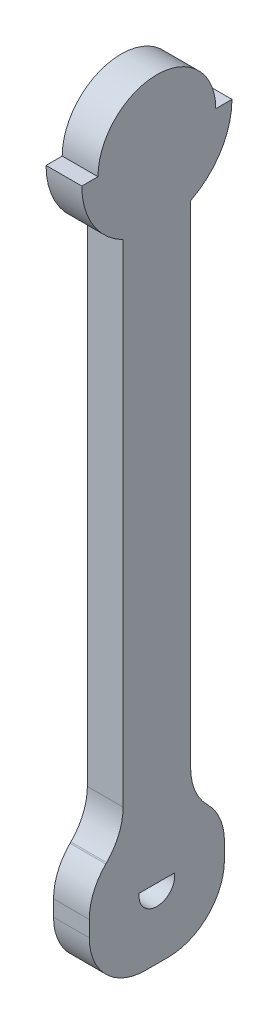
ISO-10303-21;
HEADER;
FILE_DESCRIPTION(('STEP AP214'),'2;1');
FILE_NAME('part.step','',(''),(''),'','','');
FILE_SCHEMA(('AUTOMOTIVE_DESIGN { 1 0 10303 214 1 1 1 1 }'));
ENDSEC;
DATA;
#1=APPLICATION_CONTEXT('core data for automotive mechanical design processes');
#2=APPLICATION_PROTOCOL_DEFINITION('international standard','automotive_design',2000,#1);
#3=PRODUCT_CONTEXT('',#1,'mechanical');
#4=PRODUCT('Part','Part','',(#3));
#5=PRODUCT_RELATED_PRODUCT_CATEGORY('part','',(#4));
#6=PRODUCT_DEFINITION_FORMATION('','',#4);
#7=PRODUCT_DEFINITION_CONTEXT('part definition',#1,'design');
#8=PRODUCT_DEFINITION('design','',#6,#7);
#9=PRODUCT_DEFINITION_SHAPE('','',#8);
#10=(LENGTH_UNIT() NAMED_UNIT(*) SI_UNIT(.MILLI.,.METRE.));
#11=(NAMED_UNIT(*) PLANE_ANGLE_UNIT() SI_UNIT($,.RADIAN.));
#12=(NAMED_UNIT(*) SI_UNIT($,.STERADIAN.) SOLID_ANGLE_UNIT());
#13=UNCERTAINTY_MEASURE_WITH_UNIT(LENGTH_MEASURE(1.E-05),#10,'distance_accuracy_value','');
#14=(GEOMETRIC_REPRESENTATION_CONTEXT(3) GLOBAL_UNCERTAINTY_ASSIGNED_CONTEXT((#13)) GLOBAL_UNIT_ASSIGNED_CONTEXT((#10,
#11,#12)) REPRESENTATION_CONTEXT('',''));
#15=CARTESIAN_POINT('',(0.,0.,0.));
#16=DIRECTION('',(0.,0.,1.));
#17=DIRECTION('',(1.,0.,0.));
#18=AXIS2_PLACEMENT_3D('',#15,#16,#17);
#19=CARTESIAN_POINT('',(6.35,6.00000000000001,0.));
#20=DIRECTION('',(-1.,0.,0.));
#21=DIRECTION('',(0.,0.,1.));
#22=AXIS2_PLACEMENT_3D('',#19,#20,#21);
#23=CYLINDRICAL_SURFACE('',#22,3.175);
#24=CARTESIAN_POINT('',(0.,6.00000000000001,0.));
#25=DIRECTION('',(1.,0.,0.));
#26=DIRECTION('',(0.,0.,-1.));
#27=AXIS2_PLACEMENT_3D('',#24,#25,#26);
#28=CIRCLE('',#27,3.175);
#29=CARTESIAN_POINT('',(0.,6.42500000000001,3.14642654451045));
#30=VERTEX_POINT('',#29);
#31=CARTESIAN_POINT('',(0.,6.42500000000001,-3.14642654451045));
#32=VERTEX_POINT('',#31);
#33=EDGE_CURVE('E204',#30,#32,#28,.T.);
#34=ORIENTED_EDGE('',*,*,#33,.F.);
#35=DIRECTION('',(-1.,0.,0.));
#36=VECTOR('',#35,1.);
#37=CARTESIAN_POINT('',(6.35,6.42500000000001,3.14642654451045));
#38=LINE('',#37,#36);
#39=CARTESIAN_POINT('',(6.35,6.42500000000001,3.14642654451045));
#40=VERTEX_POINT('',#39);
#41=EDGE_CURVE('E266',#40,#30,#38,.T.);
#42=ORIENTED_EDGE('',*,*,#41,.F.);
#43=CARTESIAN_POINT('',(6.35,6.00000000000001,0.));
#44=DIRECTION('',(1.,0.,0.));
#45=DIRECTION('',(0.,0.,-1.));
#46=AXIS2_PLACEMENT_3D('',#43,#44,#45);
#47=CIRCLE('',#46,3.175);
#48=CARTESIAN_POINT('',(6.35,6.42500000000001,-3.14642654451045));
#49=VERTEX_POINT('',#48);
#50=EDGE_CURVE('E228',#40,#49,#47,.T.);
#51=ORIENTED_EDGE('',*,*,#50,.T.);
#52=DIRECTION('',(-1.,0.,0.));
#53=VECTOR('',#52,1.);
#54=CARTESIAN_POINT('',(6.35,6.42500000000001,-3.14642654451045));
#55=LINE('',#54,#53);
#56=EDGE_CURVE('E185',#49,#32,#55,.T.);
#57=ORIENTED_EDGE('',*,*,#56,.T.);
#58=EDGE_LOOP('',(#34,#42,#51,#57));
#59=FACE_BOUND('',#58,.T.);
#60=ADVANCED_FACE('F35',(#59),#23,.F.);
#61=CARTESIAN_POINT('',(6.35,0.,-6.00000000000001));
#62=DIRECTION('',(0.,0.,-1.));
#63=DIRECTION('',(0.,1.,0.));
#64=AXIS2_PLACEMENT_3D('',#61,#62,#63);
#65=PLANE('',#64);
#66=DIRECTION('',(0.,-1.,0.));
#67=VECTOR('',#66,1.);
#68=CARTESIAN_POINT('',(6.35,0.,-6.00000000000001));
#69=LINE('',#68,#67);
#70=CARTESIAN_POINT('',(6.35,108.391086321582,-5.99999999999995));
#71=VERTEX_POINT('',#70);
#72=CARTESIAN_POINT('',(6.35,21.1126983722081,-6.));
#73=VERTEX_POINT('',#72);
#74=EDGE_CURVE('E178',#71,#73,#69,.T.);
#75=ORIENTED_EDGE('',*,*,#74,.T.);
#76=DIRECTION('',(-1.,0.,0.));
#77=VECTOR('',#76,1.);
#78=CARTESIAN_POINT('',(6.35,21.1126983722081,-6.));
#79=LINE('',#78,#77);
#80=CARTESIAN_POINT('',(0.,21.1126983722081,-6.));
#81=VERTEX_POINT('',#80);
#82=EDGE_CURVE('E268',#73,#81,#79,.T.);
#83=ORIENTED_EDGE('',*,*,#82,.T.);
#84=DIRECTION('',(0.,-1.,0.));
#85=VECTOR('',#84,1.);
#86=CARTESIAN_POINT('',(0.,0.,-6.00000000000001));
#87=LINE('',#86,#85);
#88=CARTESIAN_POINT('',(0.,108.391086321582,-5.99999999999995));
#89=VERTEX_POINT('',#88);
#90=EDGE_CURVE('E181',#89,#81,#87,.T.);
#91=ORIENTED_EDGE('',*,*,#90,.F.);
#92=DIRECTION('',(-1.,0.,0.));
#93=VECTOR('',#92,1.);
#94=CARTESIAN_POINT('',(6.35,108.391086321582,-5.99999999999995));
#95=LINE('',#94,#93);
#96=EDGE_CURVE('E173',#71,#89,#95,.T.);
#97=ORIENTED_EDGE('',*,*,#96,.F.);
#98=EDGE_LOOP('',(#75,#83,#91,#97));
#99=FACE_BOUND('',#98,.T.);
#100=ADVANCED_FACE('F175',(#99),#65,.T.);
#101=CARTESIAN_POINT('',(6.35,120.3,0.));
#102=DIRECTION('',(-1.,0.,0.));
#103=DIRECTION('',(0.,0.,1.));
#104=AXIS2_PLACEMENT_3D('',#101,#102,#103);
#105=CYLINDRICAL_SURFACE('',#104,13.335);
#106=CARTESIAN_POINT('',(0.,120.3,0.));
#107=DIRECTION('',(1.,0.,0.));
#108=DIRECTION('',(0.,0.,-1.));
#109=AXIS2_PLACEMENT_3D('',#106,#107,#108);
#110=CIRCLE('',#109,13.335);
#111=CARTESIAN_POINT('',(0.,120.3,-13.335));
#112=VERTEX_POINT('',#111);
#113=EDGE_CURVE('E235',#89,#112,#110,.T.);
#114=ORIENTED_EDGE('',*,*,#113,.T.);
#115=DIRECTION('',(-1.,0.,0.));
#116=VECTOR('',#115,1.);
#117=CARTESIAN_POINT('',(6.35,120.3,-13.335));
#118=LINE('',#117,#116);
#119=CARTESIAN_POINT('',(6.35,120.3,-13.335));
#120=VERTEX_POINT('',#119);
#121=EDGE_CURVE('E186',#120,#112,#118,.T.);
#122=ORIENTED_EDGE('',*,*,#121,.F.);
#123=CARTESIAN_POINT('',(6.35,120.3,0.));
#124=DIRECTION('',(1.,0.,0.));
#125=DIRECTION('',(0.,0.,-1.));
#126=AXIS2_PLACEMENT_3D('',#123,#124,#125);
#127=CIRCLE('',#126,13.335);
#128=EDGE_CURVE('E189',#71,#120,#127,.T.);
#129=ORIENTED_EDGE('',*,*,#128,.F.);
#130=ORIENTED_EDGE('',*,*,#96,.T.);
#131=EDGE_LOOP('',(#114,#122,#129,#130));
#132=FACE_BOUND('',#131,.T.);
#133=ADVANCED_FACE('F190',(#132),#105,.T.);
#134=CARTESIAN_POINT('',(6.35,120.3,0.));
#135=DIRECTION('',(0.,1.,0.));
#136=DIRECTION('',(0.,0.,1.));
#137=AXIS2_PLACEMENT_3D('',#134,#135,#136);
#138=PLANE('',#137);
#139=DIRECTION('',(0.,0.,-1.));
#140=VECTOR('',#139,1.);
#141=CARTESIAN_POINT('',(0.,120.3,0.));
#142=LINE('',#141,#140);
#143=CARTESIAN_POINT('',(0.,120.3,-10.4648));
#144=VERTEX_POINT('',#143);
#145=EDGE_CURVE('E237',#144,#112,#142,.T.);
#146=ORIENTED_EDGE('',*,*,#145,.F.);
#147=DIRECTION('',(-1.,0.,0.));
#148=VECTOR('',#147,1.);
#149=CARTESIAN_POINT('',(6.35,120.3,-10.4648));
#150=LINE('',#149,#148);
#151=CARTESIAN_POINT('',(6.35,120.3,-10.4648));
#152=VERTEX_POINT('',#151);
#153=EDGE_CURVE('E277',#152,#144,#150,.T.);
#154=ORIENTED_EDGE('',*,*,#153,.F.);
#155=DIRECTION('',(0.,0.,-1.));
#156=VECTOR('',#155,1.);
#157=CARTESIAN_POINT('',(6.35,120.3,0.));
#158=LINE('',#157,#156);
#159=EDGE_CURVE('E193',#152,#120,#158,.T.);
#160=ORIENTED_EDGE('',*,*,#159,.T.);
#161=ORIENTED_EDGE('',*,*,#121,.T.);
#162=EDGE_LOOP('',(#146,#154,#160,#161));
#163=FACE_BOUND('',#162,.T.);
#164=ADVANCED_FACE('F418',(#163),#138,.T.);
#165=CARTESIAN_POINT('',(6.35,120.3,0.));
#166=DIRECTION('',(-1.,0.,0.));
#167=DIRECTION('',(0.,0.,1.));
#168=AXIS2_PLACEMENT_3D('',#165,#166,#167);
#169=CYLINDRICAL_SURFACE('',#168,10.4648);
#170=CARTESIAN_POINT('',(0.,120.3,0.));
#171=DIRECTION('',(1.,0.,0.));
#172=DIRECTION('',(0.,0.,-1.));
#173=AXIS2_PLACEMENT_3D('',#170,#171,#172);
#174=CIRCLE('',#173,10.4648);
#175=CARTESIAN_POINT('',(0.,120.3,10.4648));
#176=VERTEX_POINT('',#175);
#177=EDGE_CURVE('E240',#144,#176,#174,.T.);
#178=ORIENTED_EDGE('',*,*,#177,.T.);
#179=DIRECTION('',(-1.,0.,0.));
#180=VECTOR('',#179,1.);
#181=CARTESIAN_POINT('',(6.35,120.3,10.4648));
#182=LINE('',#181,#180);
#183=CARTESIAN_POINT('',(6.35,120.3,10.4648));
#184=VERTEX_POINT('',#183);
#185=EDGE_CURVE('E274',#184,#176,#182,.T.);
#186=ORIENTED_EDGE('',*,*,#185,.F.);
#187=CARTESIAN_POINT('',(6.35,120.3,0.));
#188=DIRECTION('',(1.,0.,0.));
#189=DIRECTION('',(0.,0.,-1.));
#190=AXIS2_PLACEMENT_3D('',#187,#188,#189);
#191=CIRCLE('',#190,10.4648);
#192=EDGE_CURVE('E208',#152,#184,#191,.T.);
#193=ORIENTED_EDGE('',*,*,#192,.F.);
#194=ORIENTED_EDGE('',*,*,#153,.T.);
#195=EDGE_LOOP('',(#178,#186,#193,#194));
#196=FACE_BOUND('',#195,.T.);
#197=ADVANCED_FACE('F414',(#196),#169,.T.);
#198=CARTESIAN_POINT('',(6.35,120.3,0.));
#199=DIRECTION('',(0.,-1.,0.));
#200=DIRECTION('',(0.,0.,-1.));
#201=AXIS2_PLACEMENT_3D('',#198,#199,#200);
#202=PLANE('',#201);
#203=DIRECTION('',(0.,0.,1.));
#204=VECTOR('',#203,1.);
#205=CARTESIAN_POINT('',(0.,120.3,0.));
#206=LINE('',#205,#204);
#207=CARTESIAN_POINT('',(0.,120.3,13.335));
#208=VERTEX_POINT('',#207);
#209=EDGE_CURVE('E242',#176,#208,#206,.T.);
#210=ORIENTED_EDGE('',*,*,#209,.T.);
#211=DIRECTION('',(-1.,0.,0.));
#212=VECTOR('',#211,1.);
#213=CARTESIAN_POINT('',(6.35,120.3,13.335));
#214=LINE('',#213,#212);
#215=CARTESIAN_POINT('',(6.35,120.3,13.335));
#216=VERTEX_POINT('',#215);
#217=EDGE_CURVE('E271',#216,#208,#214,.T.);
#218=ORIENTED_EDGE('',*,*,#217,.F.);
#219=DIRECTION('',(0.,0.,1.));
#220=VECTOR('',#219,1.);
#221=CARTESIAN_POINT('',(6.35,120.3,0.));
#222=LINE('',#221,#220);
#223=EDGE_CURVE('E210',#184,#216,#222,.T.);
#224=ORIENTED_EDGE('',*,*,#223,.F.);
#225=ORIENTED_EDGE('',*,*,#185,.T.);
#226=EDGE_LOOP('',(#210,#218,#224,#225));
#227=FACE_BOUND('',#226,.T.);
#228=ADVANCED_FACE('F410',(#227),#202,.F.);
#229=CARTESIAN_POINT('',(6.35,120.3,0.));
#230=DIRECTION('',(-1.,0.,0.));
#231=DIRECTION('',(0.,0.,1.));
#232=AXIS2_PLACEMENT_3D('',#229,#230,#231);
#233=CYLINDRICAL_SURFACE('',#232,13.335);
#234=CARTESIAN_POINT('',(0.,120.3,0.));
#235=DIRECTION('',(1.,0.,0.));
#236=DIRECTION('',(0.,0.,-1.));
#237=AXIS2_PLACEMENT_3D('',#234,#235,#236);
#238=CIRCLE('',#237,13.335);
#239=CARTESIAN_POINT('',(0.,108.391086321583,6.00000000000005));
#240=VERTEX_POINT('',#239);
#241=EDGE_CURVE('E244',#208,#240,#238,.T.);
#242=ORIENTED_EDGE('',*,*,#241,.T.);
#243=DIRECTION('',(-1.,0.,0.));
#244=VECTOR('',#243,1.);
#245=CARTESIAN_POINT('',(6.35,108.391086321583,6.00000000000005));
#246=LINE('',#245,#244);
#247=CARTESIAN_POINT('',(6.35,108.391086321583,6.00000000000005));
#248=VERTEX_POINT('',#247);
#249=EDGE_CURVE('E233',#248,#240,#246,.T.);
#250=ORIENTED_EDGE('',*,*,#249,.F.);
#251=CARTESIAN_POINT('',(6.35,120.3,0.));
#252=DIRECTION('',(1.,0.,0.));
#253=DIRECTION('',(0.,0.,-1.));
#254=AXIS2_PLACEMENT_3D('',#251,#252,#253);
#255=CIRCLE('',#254,13.335);
#256=EDGE_CURVE('E212',#216,#248,#255,.T.);
#257=ORIENTED_EDGE('',*,*,#256,.F.);
#258=ORIENTED_EDGE('',*,*,#217,.T.);
#259=EDGE_LOOP('',(#242,#250,#257,#258));
#260=FACE_BOUND('',#259,.T.);
#261=ADVANCED_FACE('F407',(#260),#233,.T.);
#262=CARTESIAN_POINT('',(6.35,0.,5.99999999999999));
#263=DIRECTION('',(0.,0.,-1.));
#264=DIRECTION('',(0.,1.,0.));
#265=AXIS2_PLACEMENT_3D('',#262,#263,#264);
#266=PLANE('',#265);
#267=DIRECTION('',(0.,-1.,0.));
#268=VECTOR('',#267,1.);
#269=CARTESIAN_POINT('',(0.,0.,5.99999999999999));
#270=LINE('',#269,#268);
#271=CARTESIAN_POINT('',(0.,21.1126983722081,6.));
#272=VERTEX_POINT('',#271);
#273=EDGE_CURVE('E246',#240,#272,#270,.T.);
#274=ORIENTED_EDGE('',*,*,#273,.T.);
#275=DIRECTION('',(-1.,0.,0.));
#276=VECTOR('',#275,1.);
#277=CARTESIAN_POINT('',(6.35,21.1126983722081,6.));
#278=LINE('',#277,#276);
#279=CARTESIAN_POINT('',(6.35,21.1126983722081,6.));
#280=VERTEX_POINT('',#279);
#281=EDGE_CURVE('E320',#272,#280,#278,.F.);
#282=ORIENTED_EDGE('',*,*,#281,.T.);
#283=DIRECTION('',(0.,-1.,0.));
#284=VECTOR('',#283,1.);
#285=CARTESIAN_POINT('',(6.35,0.,5.99999999999999));
#286=LINE('',#285,#284);
#287=EDGE_CURVE('E214',#248,#280,#286,.T.);
#288=ORIENTED_EDGE('',*,*,#287,.F.);
#289=ORIENTED_EDGE('',*,*,#249,.T.);
#290=EDGE_LOOP('',(#274,#282,#288,#289));
#291=FACE_BOUND('',#290,.T.);
#292=ADVANCED_FACE('F335',(#291),#266,.F.);
#293=CARTESIAN_POINT('',(6.35,11.4852813742386,11.4852813742386));
#294=DIRECTION('',(0.,-0.707106781186548,-0.707106781186547));
#295=DIRECTION('',(0.,0.707106781186547,-0.707106781186548));
#296=AXIS2_PLACEMENT_3D('',#293,#294,#295);
#297=PLANE('',#296);
#298=DIRECTION('',(0.,-0.707106781186547,0.707106781186548));
#299=VECTOR('',#298,1.);
#300=CARTESIAN_POINT('',(0.,11.4852813742386,11.4852813742386));
#301=LINE('',#300,#299);
#302=CARTESIAN_POINT('',(0.,14.0416305603426,8.92893218813453));
#303=VERTEX_POINT('',#302);
#304=CARTESIAN_POINT('',(0.,13.8994949366117,9.07106781186547));
#305=VERTEX_POINT('',#304);
#306=EDGE_CURVE('E249',#303,#305,#301,.T.);
#307=ORIENTED_EDGE('',*,*,#306,.T.);
#308=DIRECTION('',(-1.,0.,0.));
#309=VECTOR('',#308,1.);
#310=CARTESIAN_POINT('',(6.35,13.8994949366117,9.07106781186547));
#311=LINE('',#310,#309);
#312=CARTESIAN_POINT('',(6.35,13.8994949366117,9.07106781186547));
#313=VERTEX_POINT('',#312);
#314=EDGE_CURVE('E318',#305,#313,#311,.F.);
#315=ORIENTED_EDGE('',*,*,#314,.T.);
#316=DIRECTION('',(0.,-0.707106781186547,0.707106781186548));
#317=VECTOR('',#316,1.);
#318=CARTESIAN_POINT('',(6.35,11.4852813742386,11.4852813742386));
#319=LINE('',#318,#317);
#320=CARTESIAN_POINT('',(6.35,14.0416305603426,8.92893218813453));
#321=VERTEX_POINT('',#320);
#322=EDGE_CURVE('E217',#321,#313,#319,.T.);
#323=ORIENTED_EDGE('',*,*,#322,.F.);
#324=DIRECTION('',(-1.,0.,0.));
#325=VECTOR('',#324,1.);
#326=CARTESIAN_POINT('',(0.,14.0416305603426,8.92893218813453));
#327=LINE('',#326,#325);
#328=EDGE_CURVE('E315',#321,#303,#327,.T.);
#329=ORIENTED_EDGE('',*,*,#328,.T.);
#330=EDGE_LOOP('',(#307,#315,#323,#329));
#331=FACE_BOUND('',#330,.T.);
#332=ADVANCED_FACE('F342',(#331),#297,.F.);
#333=CARTESIAN_POINT('',(6.35,0.,12.));
#334=DIRECTION('',(0.,0.,-1.));
#335=DIRECTION('',(0.,1.,0.));
#336=AXIS2_PLACEMENT_3D('',#333,#334,#335);
#337=PLANE('',#336);
#338=DIRECTION('',(0.,-1.,0.));
#339=VECTOR('',#338,1.);
#340=CARTESIAN_POINT('',(0.,0.,12.));
#341=LINE('',#340,#339);
#342=CARTESIAN_POINT('',(0.,6.82842712474619,12.));
#343=VERTEX_POINT('',#342);
#344=CARTESIAN_POINT('',(0.,4.00000000000001,12.));
#345=VERTEX_POINT('',#344);
#346=EDGE_CURVE('E252',#343,#345,#341,.T.);
#347=ORIENTED_EDGE('',*,*,#346,.T.);
#348=DIRECTION('',(-1.,0.,0.));
#349=VECTOR('',#348,1.);
#350=CARTESIAN_POINT('',(6.35,4.00000000000001,12.));
#351=LINE('',#350,#349);
#352=CARTESIAN_POINT('',(6.35,4.00000000000001,12.));
#353=VERTEX_POINT('',#352);
#354=EDGE_CURVE('E313',#345,#353,#351,.F.);
#355=ORIENTED_EDGE('',*,*,#354,.T.);
#356=DIRECTION('',(0.,-1.,0.));
#357=VECTOR('',#356,1.);
#358=CARTESIAN_POINT('',(6.35,0.,12.));
#359=LINE('',#358,#357);
#360=CARTESIAN_POINT('',(6.35,6.82842712474619,12.));
#361=VERTEX_POINT('',#360);
#362=EDGE_CURVE('E220',#361,#353,#359,.T.);
#363=ORIENTED_EDGE('',*,*,#362,.F.);
#364=DIRECTION('',(-1.,0.,0.));
#365=VECTOR('',#364,1.);
#366=CARTESIAN_POINT('',(6.35,6.82842712474619,12.));
#367=LINE('',#366,#365);
#368=EDGE_CURVE('E310',#361,#343,#367,.T.);
#369=ORIENTED_EDGE('',*,*,#368,.T.);
#370=EDGE_LOOP('',(#347,#355,#363,#369));
#371=FACE_BOUND('',#370,.T.);
#372=ADVANCED_FACE('F349',(#371),#337,.F.);
#373=CARTESIAN_POINT('',(6.35,-5.99999999999999,0.));
#374=DIRECTION('',(0.,1.,0.));
#375=DIRECTION('',(0.,0.,1.));
#376=AXIS2_PLACEMENT_3D('',#373,#374,#375);
#377=PLANE('',#376);
#378=DIRECTION('',(0.,0.,-1.));
#379=VECTOR('',#378,1.);
#380=CARTESIAN_POINT('',(0.,-5.99999999999999,0.));
#381=LINE('',#380,#379);
#382=CARTESIAN_POINT('',(0.,-5.99999999999999,2.));
#383=VERTEX_POINT('',#382);
#384=CARTESIAN_POINT('',(0.,-5.99999999999999,-2.));
#385=VERTEX_POINT('',#384);
#386=EDGE_CURVE('E255',#383,#385,#381,.T.);
#387=ORIENTED_EDGE('',*,*,#386,.T.);
#388=DIRECTION('',(-1.,0.,0.));
#389=VECTOR('',#388,1.);
#390=CARTESIAN_POINT('',(6.35,-5.99999999999999,-2.));
#391=LINE('',#390,#389);
#392=CARTESIAN_POINT('',(6.35,-5.99999999999999,-2.));
#393=VERTEX_POINT('',#392);
#394=EDGE_CURVE('E50',#385,#393,#391,.F.);
#395=ORIENTED_EDGE('',*,*,#394,.T.);
#396=DIRECTION('',(0.,0.,-1.));
#397=VECTOR('',#396,1.);
#398=CARTESIAN_POINT('',(6.35,-5.99999999999999,0.));
#399=LINE('',#398,#397);
#400=CARTESIAN_POINT('',(6.35,-5.99999999999999,2.));
#401=VERTEX_POINT('',#400);
#402=EDGE_CURVE('E222',#401,#393,#399,.T.);
#403=ORIENTED_EDGE('',*,*,#402,.F.);
#404=DIRECTION('',(-1.,0.,0.));
#405=VECTOR('',#404,1.);
#406=CARTESIAN_POINT('',(6.35,-5.99999999999999,2.));
#407=LINE('',#406,#405);
#408=EDGE_CURVE('E306',#401,#383,#407,.T.);
#409=ORIENTED_EDGE('',*,*,#408,.T.);
#410=EDGE_LOOP('',(#387,#395,#403,#409));
#411=FACE_BOUND('',#410,.T.);
#412=ADVANCED_FACE('F356',(#411),#377,.F.);
#413=CARTESIAN_POINT('',(6.35,0.,-12.));
#414=DIRECTION('',(0.,0.,1.));
#415=DIRECTION('',(1.,0.,0.));
#416=AXIS2_PLACEMENT_3D('',#413,#414,#415);
#417=PLANE('',#416);
#418=DIRECTION('',(0.,1.,0.));
#419=VECTOR('',#418,1.);
#420=CARTESIAN_POINT('',(0.,0.,-12.));
#421=LINE('',#420,#419);
#422=CARTESIAN_POINT('',(0.,4.00000000000001,-12.));
#423=VERTEX_POINT('',#422);
#424=CARTESIAN_POINT('',(0.,6.82842712474619,-12.));
#425=VERTEX_POINT('',#424);
#426=EDGE_CURVE('E257',#423,#425,#421,.T.);
#427=ORIENTED_EDGE('',*,*,#426,.T.);
#428=DIRECTION('',(-1.,0.,0.));
#429=VECTOR('',#428,1.);
#430=CARTESIAN_POINT('',(6.35,6.82842712474619,-12.));
#431=LINE('',#430,#429);
#432=CARTESIAN_POINT('',(6.35,6.82842712474619,-12.));
#433=VERTEX_POINT('',#432);
#434=EDGE_CURVE('E297',#425,#433,#431,.F.);
#435=ORIENTED_EDGE('',*,*,#434,.T.);
#436=DIRECTION('',(0.,1.,0.));
#437=VECTOR('',#436,1.);
#438=CARTESIAN_POINT('',(6.35,0.,-12.));
#439=LINE('',#438,#437);
#440=CARTESIAN_POINT('',(6.35,4.00000000000001,-12.));
#441=VERTEX_POINT('',#440);
#442=EDGE_CURVE('E224',#441,#433,#439,.T.);
#443=ORIENTED_EDGE('',*,*,#442,.F.);
#444=DIRECTION('',(-1.,0.,0.));
#445=VECTOR('',#444,1.);
#446=CARTESIAN_POINT('',(6.35,4.00000000000001,-12.));
#447=LINE('',#446,#445);
#448=EDGE_CURVE('E294',#441,#423,#447,.T.);
#449=ORIENTED_EDGE('',*,*,#448,.T.);
#450=EDGE_LOOP('',(#427,#435,#443,#449));
#451=FACE_BOUND('',#450,.T.);
#452=ADVANCED_FACE('F364',(#451),#417,.F.);
#453=CARTESIAN_POINT('',(6.35,11.4852813742385,-11.4852813742386));
#454=DIRECTION('',(0.,-0.707106781186544,0.70710678118655));
#455=DIRECTION('',(0.,-0.707106781186551,-0.707106781186545));
#456=AXIS2_PLACEMENT_3D('',#453,#454,#455);
#457=PLANE('',#456);
#458=DIRECTION('',(0.,0.707106781186551,0.707106781186545));
#459=VECTOR('',#458,1.);
#460=CARTESIAN_POINT('',(0.,11.4852813742385,-11.4852813742386));
#461=LINE('',#460,#459);
#462=CARTESIAN_POINT('',(0.,13.8994949366116,-9.07106781186551));
#463=VERTEX_POINT('',#462);
#464=CARTESIAN_POINT('',(0.,14.0416305603426,-8.9289321881345));
#465=VERTEX_POINT('',#464);
#466=EDGE_CURVE('E260',#463,#465,#461,.T.);
#467=ORIENTED_EDGE('',*,*,#466,.T.);
#468=DIRECTION('',(-1.,0.,0.));
#469=VECTOR('',#468,1.);
#470=CARTESIAN_POINT('',(6.35,14.0416305603426,-8.9289321881345));
#471=LINE('',#470,#469);
#472=CARTESIAN_POINT('',(6.35,14.0416305603426,-8.9289321881345));
#473=VERTEX_POINT('',#472);
#474=EDGE_CURVE('E284',#465,#473,#471,.F.);
#475=ORIENTED_EDGE('',*,*,#474,.T.);
#476=DIRECTION('',(0.,0.707106781186551,0.707106781186545));
#477=VECTOR('',#476,1.);
#478=CARTESIAN_POINT('',(6.35,11.4852813742385,-11.4852813742386));
#479=LINE('',#478,#477);
#480=CARTESIAN_POINT('',(6.35,13.8994949366116,-9.07106781186551));
#481=VERTEX_POINT('',#480);
#482=EDGE_CURVE('E226',#481,#473,#479,.T.);
#483=ORIENTED_EDGE('',*,*,#482,.F.);
#484=DIRECTION('',(-1.,0.,0.));
#485=VECTOR('',#484,1.);
#486=CARTESIAN_POINT('',(6.35,13.8994949366116,-9.07106781186551));
#487=LINE('',#486,#485);
#488=EDGE_CURVE('E281',#481,#463,#487,.T.);
#489=ORIENTED_EDGE('',*,*,#488,.T.);
#490=EDGE_LOOP('',(#467,#475,#483,#489));
#491=FACE_BOUND('',#490,.T.);
#492=ADVANCED_FACE('F372',(#491),#457,.F.);
#493=CARTESIAN_POINT('',(6.35,6.42500000000001,0.));
#494=DIRECTION('',(0.,1.,0.));
#495=DIRECTION('',(0.,0.,1.));
#496=AXIS2_PLACEMENT_3D('',#493,#494,#495);
#497=PLANE('',#496);
#498=DIRECTION('',(0.,0.,-1.));
#499=VECTOR('',#498,1.);
#500=CARTESIAN_POINT('',(0.,6.42500000000001,0.));
#501=LINE('',#500,#499);
#502=EDGE_CURVE('E201',#30,#32,#501,.T.);
#503=ORIENTED_EDGE('',*,*,#502,.T.);
#504=ORIENTED_EDGE('',*,*,#56,.F.);
#505=DIRECTION('',(0.,0.,-1.));
#506=VECTOR('',#505,1.);
#507=CARTESIAN_POINT('',(6.35,6.42500000000001,0.));
#508=LINE('',#507,#506);
#509=EDGE_CURVE('E231',#40,#49,#508,.T.);
#510=ORIENTED_EDGE('',*,*,#509,.F.);
#511=ORIENTED_EDGE('',*,*,#41,.T.);
#512=EDGE_LOOP('',(#503,#504,#510,#511));
#513=FACE_BOUND('',#512,.T.);
#514=ADVANCED_FACE('F394',(#513),#497,.F.);
#515=CARTESIAN_POINT('',(6.35,0.,0.));
#516=DIRECTION('',(1.,0.,0.));
#517=DIRECTION('',(0.,0.,-1.));
#518=AXIS2_PLACEMENT_3D('',#515,#516,#517);
#519=PLANE('',#518);
#520=ORIENTED_EDGE('',*,*,#442,.T.);
#521=CARTESIAN_POINT('',(6.35,6.82842712474619,-2.));
#522=DIRECTION('',(1.,0.,0.));
#523=DIRECTION('',(0.,0.,-1.));
#524=AXIS2_PLACEMENT_3D('',#521,#522,#523);
#525=CIRCLE('',#524,10.);
#526=EDGE_CURVE('E304',#433,#481,#525,.T.);
#527=ORIENTED_EDGE('',*,*,#526,.T.);
#528=ORIENTED_EDGE('',*,*,#482,.T.);
#529=CARTESIAN_POINT('',(6.35,21.1126983722081,-16.));
#530=DIRECTION('',(1.,0.,0.));
#531=DIRECTION('',(0.,0.,-1.));
#532=AXIS2_PLACEMENT_3D('',#529,#530,#531);
#533=CIRCLE('',#532,10.);
#534=EDGE_CURVE('E200',#473,#73,#533,.F.);
#535=ORIENTED_EDGE('',*,*,#534,.T.);
#536=ORIENTED_EDGE('',*,*,#74,.F.);
#537=ORIENTED_EDGE('',*,*,#128,.T.);
#538=ORIENTED_EDGE('',*,*,#159,.F.);
#539=ORIENTED_EDGE('',*,*,#192,.T.);
#540=ORIENTED_EDGE('',*,*,#223,.T.);
#541=ORIENTED_EDGE('',*,*,#256,.T.);
#542=ORIENTED_EDGE('',*,*,#287,.T.);
#543=CARTESIAN_POINT('',(6.35,21.1126983722081,16.));
#544=DIRECTION('',(1.,0.,0.));
#545=DIRECTION('',(0.,0.,-1.));
#546=AXIS2_PLACEMENT_3D('',#543,#544,#545);
#547=CIRCLE('',#546,10.);
#548=EDGE_CURVE('E11',#280,#321,#547,.F.);
#549=ORIENTED_EDGE('',*,*,#548,.T.);
#550=ORIENTED_EDGE('',*,*,#322,.T.);
#551=CARTESIAN_POINT('',(6.35,6.82842712474619,2.));
#552=DIRECTION('',(1.,0.,0.));
#553=DIRECTION('',(0.,0.,-1.));
#554=AXIS2_PLACEMENT_3D('',#551,#552,#553);
#555=CIRCLE('',#554,10.);
#556=EDGE_CURVE('E299',#313,#361,#555,.T.);
#557=ORIENTED_EDGE('',*,*,#556,.T.);
#558=ORIENTED_EDGE('',*,*,#362,.T.);
#559=CARTESIAN_POINT('',(6.35,4.00000000000001,2.));
#560=DIRECTION('',(1.,0.,0.));
#561=DIRECTION('',(0.,0.,-1.));
#562=AXIS2_PLACEMENT_3D('',#559,#560,#561);
#563=CIRCLE('',#562,10.);
#564=EDGE_CURVE('E57',#353,#401,#563,.T.);
#565=ORIENTED_EDGE('',*,*,#564,.T.);
#566=ORIENTED_EDGE('',*,*,#402,.T.);
#567=CARTESIAN_POINT('',(6.35,4.00000000000001,-2.));
#568=DIRECTION('',(1.,0.,0.));
#569=DIRECTION('',(0.,0.,-1.));
#570=AXIS2_PLACEMENT_3D('',#567,#568,#569);
#571=CIRCLE('',#570,10.);
#572=EDGE_CURVE('E302',#393,#441,#571,.T.);
#573=ORIENTED_EDGE('',*,*,#572,.T.);
#574=EDGE_LOOP('',(#520,#527,#528,#535,#536,#537,#538,#539,#540,#541,#542,#549,#550,#557,#558,
#565,#566,#573));
#575=FACE_BOUND('',#574,.T.);
#576=ORIENTED_EDGE('',*,*,#50,.F.);
#577=ORIENTED_EDGE('',*,*,#509,.T.);
#578=EDGE_LOOP('',(#576,#577));
#579=FACE_BOUND('',#578,.T.);
#580=ADVANCED_FACE('F196',(#575,#579),#519,.T.);
#581=CARTESIAN_POINT('',(0.,0.,0.));
#582=DIRECTION('',(1.,0.,0.));
#583=DIRECTION('',(0.,0.,-1.));
#584=AXIS2_PLACEMENT_3D('',#581,#582,#583);
#585=PLANE('',#584);
#586=ORIENTED_EDGE('',*,*,#466,.F.);
#587=CARTESIAN_POINT('',(0.,6.82842712474619,-2.));
#588=DIRECTION('',(1.,0.,0.));
#589=DIRECTION('',(0.,0.,-1.));
#590=AXIS2_PLACEMENT_3D('',#587,#588,#589);
#591=CIRCLE('',#590,10.);
#592=EDGE_CURVE('E292',#463,#425,#591,.F.);
#593=ORIENTED_EDGE('',*,*,#592,.T.);
#594=ORIENTED_EDGE('',*,*,#426,.F.);
#595=CARTESIAN_POINT('',(0.,4.00000000000001,-2.));
#596=DIRECTION('',(1.,0.,0.));
#597=DIRECTION('',(0.,0.,-1.));
#598=AXIS2_PLACEMENT_3D('',#595,#596,#597);
#599=CIRCLE('',#598,10.);
#600=EDGE_CURVE('E290',#423,#385,#599,.F.);
#601=ORIENTED_EDGE('',*,*,#600,.T.);
#602=ORIENTED_EDGE('',*,*,#386,.F.);
#603=CARTESIAN_POINT('',(0.,4.00000000000001,2.));
#604=DIRECTION('',(1.,0.,0.));
#605=DIRECTION('',(0.,0.,-1.));
#606=AXIS2_PLACEMENT_3D('',#603,#604,#605);
#607=CIRCLE('',#606,10.);
#608=EDGE_CURVE('E288',#383,#345,#607,.F.);
#609=ORIENTED_EDGE('',*,*,#608,.T.);
#610=ORIENTED_EDGE('',*,*,#346,.F.);
#611=CARTESIAN_POINT('',(0.,6.82842712474619,2.));
#612=DIRECTION('',(1.,0.,0.));
#613=DIRECTION('',(0.,0.,-1.));
#614=AXIS2_PLACEMENT_3D('',#611,#612,#613);
#615=CIRCLE('',#614,10.);
#616=EDGE_CURVE('E286',#343,#305,#615,.F.);
#617=ORIENTED_EDGE('',*,*,#616,.T.);
#618=ORIENTED_EDGE('',*,*,#306,.F.);
#619=CARTESIAN_POINT('',(0.,21.1126983722081,16.));
#620=DIRECTION('',(1.,0.,0.));
#621=DIRECTION('',(0.,0.,-1.));
#622=AXIS2_PLACEMENT_3D('',#619,#620,#621);
#623=CIRCLE('',#622,10.);
#624=EDGE_CURVE('E43',#303,#272,#623,.T.);
#625=ORIENTED_EDGE('',*,*,#624,.T.);
#626=ORIENTED_EDGE('',*,*,#273,.F.);
#627=ORIENTED_EDGE('',*,*,#241,.F.);
#628=ORIENTED_EDGE('',*,*,#209,.F.);
#629=ORIENTED_EDGE('',*,*,#177,.F.);
#630=ORIENTED_EDGE('',*,*,#145,.T.);
#631=ORIENTED_EDGE('',*,*,#113,.F.);
#632=ORIENTED_EDGE('',*,*,#90,.T.);
#633=CARTESIAN_POINT('',(0.,21.1126983722081,-16.));
#634=DIRECTION('',(1.,0.,0.));
#635=DIRECTION('',(0.,0.,-1.));
#636=AXIS2_PLACEMENT_3D('',#633,#634,#635);
#637=CIRCLE('',#636,10.);
#638=EDGE_CURVE('E322',#81,#465,#637,.T.);
#639=ORIENTED_EDGE('',*,*,#638,.T.);
#640=EDGE_LOOP('',(#586,#593,#594,#601,#602,#609,#610,#617,#618,#625,#626,#627,#628,#629,#630,
#631,#632,#639));
#641=FACE_BOUND('',#640,.T.);
#642=ORIENTED_EDGE('',*,*,#33,.T.);
#643=ORIENTED_EDGE('',*,*,#502,.F.);
#644=EDGE_LOOP('',(#642,#643));
#645=FACE_BOUND('',#644,.T.);
#646=ADVANCED_FACE('F328',(#641,#645),#585,.F.);
#647=CARTESIAN_POINT('',(6.35,21.1126983722081,-16.));
#648=DIRECTION('',(-1.,0.,0.));
#649=DIRECTION('',(0.,0.,1.));
#650=AXIS2_PLACEMENT_3D('',#647,#648,#649);
#651=CYLINDRICAL_SURFACE('',#650,10.);
#652=ORIENTED_EDGE('',*,*,#534,.F.);
#653=ORIENTED_EDGE('',*,*,#474,.F.);
#654=ORIENTED_EDGE('',*,*,#638,.F.);
#655=ORIENTED_EDGE('',*,*,#82,.F.);
#656=EDGE_LOOP('',(#652,#653,#654,#655));
#657=FACE_BOUND('',#656,.T.);
#658=ADVANCED_FACE('F375',(#657),#651,.F.);
#659=CARTESIAN_POINT('',(6.35,6.82842712474619,-2.));
#660=DIRECTION('',(-1.,0.,0.));
#661=DIRECTION('',(0.,0.,1.));
#662=AXIS2_PLACEMENT_3D('',#659,#660,#661);
#663=CYLINDRICAL_SURFACE('',#662,10.);
#664=ORIENTED_EDGE('',*,*,#526,.F.);
#665=ORIENTED_EDGE('',*,*,#434,.F.);
#666=ORIENTED_EDGE('',*,*,#592,.F.);
#667=ORIENTED_EDGE('',*,*,#488,.F.);
#668=EDGE_LOOP('',(#664,#665,#666,#667));
#669=FACE_BOUND('',#668,.T.);
#670=ADVANCED_FACE('F370',(#669),#663,.T.);
#671=CARTESIAN_POINT('',(6.35,4.00000000000001,-2.));
#672=DIRECTION('',(-1.,0.,0.));
#673=DIRECTION('',(0.,0.,1.));
#674=AXIS2_PLACEMENT_3D('',#671,#672,#673);
#675=CYLINDRICAL_SURFACE('',#674,10.);
#676=ORIENTED_EDGE('',*,*,#572,.F.);
#677=ORIENTED_EDGE('',*,*,#394,.F.);
#678=ORIENTED_EDGE('',*,*,#600,.F.);
#679=ORIENTED_EDGE('',*,*,#448,.F.);
#680=EDGE_LOOP('',(#676,#677,#678,#679));
#681=FACE_BOUND('',#680,.T.);
#682=ADVANCED_FACE('F361',(#681),#675,.T.);
#683=CARTESIAN_POINT('',(6.35,4.00000000000001,2.));
#684=DIRECTION('',(-1.,0.,0.));
#685=DIRECTION('',(0.,0.,1.));
#686=AXIS2_PLACEMENT_3D('',#683,#684,#685);
#687=CYLINDRICAL_SURFACE('',#686,10.);
#688=ORIENTED_EDGE('',*,*,#564,.F.);
#689=ORIENTED_EDGE('',*,*,#354,.F.);
#690=ORIENTED_EDGE('',*,*,#608,.F.);
#691=ORIENTED_EDGE('',*,*,#408,.F.);
#692=EDGE_LOOP('',(#688,#689,#690,#691));
#693=FACE_BOUND('',#692,.T.);
#694=ADVANCED_FACE('F353',(#693),#687,.T.);
#695=CARTESIAN_POINT('',(6.35,6.82842712474619,2.));
#696=DIRECTION('',(-1.,0.,0.));
#697=DIRECTION('',(0.,0.,1.));
#698=AXIS2_PLACEMENT_3D('',#695,#696,#697);
#699=CYLINDRICAL_SURFACE('',#698,10.);
#700=ORIENTED_EDGE('',*,*,#556,.F.);
#701=ORIENTED_EDGE('',*,*,#314,.F.);
#702=ORIENTED_EDGE('',*,*,#616,.F.);
#703=ORIENTED_EDGE('',*,*,#368,.F.);
#704=EDGE_LOOP('',(#700,#701,#702,#703));
#705=FACE_BOUND('',#704,.T.);
#706=ADVANCED_FACE('F345',(#705),#699,.T.);
#707=CARTESIAN_POINT('',(6.35,21.1126983722081,16.));
#708=DIRECTION('',(1.,0.,0.));
#709=DIRECTION('',(0.,0.,-1.));
#710=AXIS2_PLACEMENT_3D('',#707,#708,#709);
#711=CYLINDRICAL_SURFACE('',#710,10.);
#712=ORIENTED_EDGE('',*,*,#548,.F.);
#713=ORIENTED_EDGE('',*,*,#281,.F.);
#714=ORIENTED_EDGE('',*,*,#624,.F.);
#715=ORIENTED_EDGE('',*,*,#328,.F.);
#716=EDGE_LOOP('',(#712,#713,#714,#715));
#717=FACE_BOUND('',#716,.T.);
#718=ADVANCED_FACE('F37',(#717),#711,.F.);
#719=CLOSED_SHELL('',(#60,#100,#133,#164,#197,#228,#261,#292,#332,#372,#412,#452,#492,#514,#580,
#646,#658,#670,#682,#694,#706,#718));
#720=MANIFOLD_SOLID_BREP('B2',#719);
#721=ADVANCED_BREP_SHAPE_REPRESENTATION('',(#18,#720),#14);
#722=SHAPE_DEFINITION_REPRESENTATION(#9,#721);
ENDSEC;
END-ISO-10303-21;
